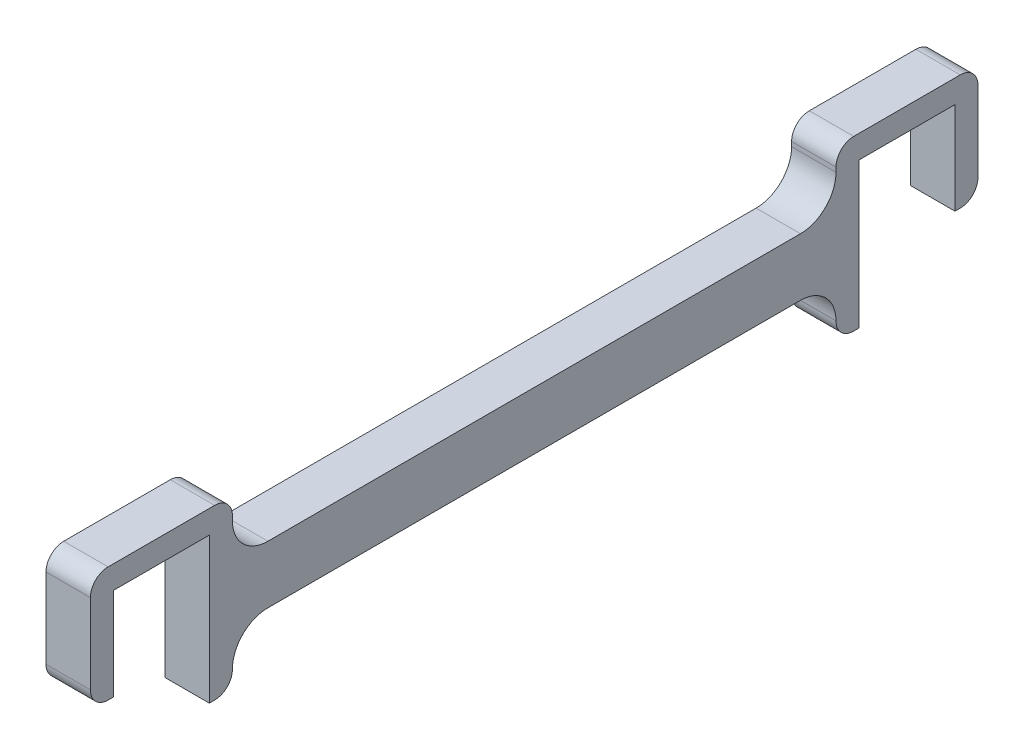
ISO-10303-21;
HEADER;
FILE_DESCRIPTION(('STEP AP214'),'2;1');
FILE_NAME('part.step','',(''),(''),'','','');
FILE_SCHEMA(('AUTOMOTIVE_DESIGN { 1 0 10303 214 1 1 1 1 }'));
ENDSEC;
DATA;
#1=APPLICATION_CONTEXT('core data for automotive mechanical design processes');
#2=APPLICATION_PROTOCOL_DEFINITION('international standard','automotive_design',2000,#1);
#3=PRODUCT_CONTEXT('',#1,'mechanical');
#4=PRODUCT('Part','Part','',(#3));
#5=PRODUCT_RELATED_PRODUCT_CATEGORY('part','',(#4));
#6=PRODUCT_DEFINITION_FORMATION('','',#4);
#7=PRODUCT_DEFINITION_CONTEXT('part definition',#1,'design');
#8=PRODUCT_DEFINITION('design','',#6,#7);
#9=PRODUCT_DEFINITION_SHAPE('','',#8);
#10=(LENGTH_UNIT() NAMED_UNIT(*) SI_UNIT(.MILLI.,.METRE.));
#11=(NAMED_UNIT(*) PLANE_ANGLE_UNIT() SI_UNIT($,.RADIAN.));
#12=(NAMED_UNIT(*) SI_UNIT($,.STERADIAN.) SOLID_ANGLE_UNIT());
#13=UNCERTAINTY_MEASURE_WITH_UNIT(LENGTH_MEASURE(1.E-05),#10,'distance_accuracy_value','');
#14=(GEOMETRIC_REPRESENTATION_CONTEXT(3) GLOBAL_UNCERTAINTY_ASSIGNED_CONTEXT((#13)) GLOBAL_UNIT_ASSIGNED_CONTEXT((#10,
#11,#12)) REPRESENTATION_CONTEXT('',''));
#15=CARTESIAN_POINT('',(0.,0.,0.));
#16=DIRECTION('',(0.,0.,1.));
#17=DIRECTION('',(1.,0.,0.));
#18=AXIS2_PLACEMENT_3D('',#15,#16,#17);
#19=CARTESIAN_POINT('',(5.,97.5,80.));
#20=DIRECTION('',(-1.,0.,0.));
#21=DIRECTION('',(0.,0.,1.));
#22=AXIS2_PLACEMENT_3D('',#19,#20,#21);
#23=CYLINDRICAL_SURFACE('',#22,4.);
#24=CARTESIAN_POINT('',(0.,97.5,80.));
#25=DIRECTION('',(1.,0.,0.));
#26=DIRECTION('',(0.,0.,-1.));
#27=AXIS2_PLACEMENT_3D('',#24,#25,#26);
#28=CIRCLE('',#27,4.);
#29=CARTESIAN_POINT('',(0.,97.5,84.));
#30=VERTEX_POINT('',#29);
#31=CARTESIAN_POINT('',(0.,93.5,80.));
#32=VERTEX_POINT('',#31);
#33=EDGE_CURVE('E278',#30,#32,#28,.T.);
#34=ORIENTED_EDGE('',*,*,#33,.F.);
#35=DIRECTION('',(-1.,0.,0.));
#36=VECTOR('',#35,1.);
#37=CARTESIAN_POINT('',(5.,97.5,84.));
#38=LINE('',#37,#36);
#39=CARTESIAN_POINT('',(5.,97.5,84.));
#40=VERTEX_POINT('',#39);
#41=EDGE_CURVE('E11',#40,#30,#38,.T.);
#42=ORIENTED_EDGE('',*,*,#41,.F.);
#43=CARTESIAN_POINT('',(5.,97.5,80.));
#44=DIRECTION('',(1.,0.,0.));
#45=DIRECTION('',(0.,0.,-1.));
#46=AXIS2_PLACEMENT_3D('',#43,#44,#45);
#47=CIRCLE('',#46,4.);
#48=CARTESIAN_POINT('',(5.,93.5,80.));
#49=VERTEX_POINT('',#48);
#50=EDGE_CURVE('E359',#40,#49,#47,.T.);
#51=ORIENTED_EDGE('',*,*,#50,.T.);
#52=DIRECTION('',(-1.,0.,0.));
#53=VECTOR('',#52,1.);
#54=CARTESIAN_POINT('',(5.,93.5,80.));
#55=LINE('',#54,#53);
#56=EDGE_CURVE('E161',#49,#32,#55,.T.);
#57=ORIENTED_EDGE('',*,*,#56,.T.);
#58=EDGE_LOOP('',(#34,#42,#51,#57));
#59=FACE_BOUND('',#58,.T.);
#60=ADVANCED_FACE('F39',(#59),#23,.F.);
#61=CARTESIAN_POINT('',(5.,0.,84.));
#62=DIRECTION('',(0.,0.,1.));
#63=DIRECTION('',(1.,0.,0.));
#64=AXIS2_PLACEMENT_3D('',#61,#62,#63);
#65=PLANE('',#64);
#66=DIRECTION('',(0.,1.,0.));
#67=VECTOR('',#66,1.);
#68=CARTESIAN_POINT('',(0.,0.,84.));
#69=LINE('',#68,#67);
#70=CARTESIAN_POINT('',(0.,98.,84.));
#71=VERTEX_POINT('',#70);
#72=EDGE_CURVE('E281',#30,#71,#69,.T.);
#73=ORIENTED_EDGE('',*,*,#72,.T.);
#74=DIRECTION('',(-1.,0.,0.));
#75=VECTOR('',#74,1.);
#76=CARTESIAN_POINT('',(5.,98.,84.));
#77=LINE('',#76,#75);
#78=CARTESIAN_POINT('',(5.,98.,84.));
#79=VERTEX_POINT('',#78);
#80=EDGE_CURVE('E47',#79,#71,#77,.T.);
#81=ORIENTED_EDGE('',*,*,#80,.F.);
#82=DIRECTION('',(0.,1.,0.));
#83=VECTOR('',#82,1.);
#84=CARTESIAN_POINT('',(5.,0.,84.));
#85=LINE('',#84,#83);
#86=EDGE_CURVE('E448',#40,#79,#85,.T.);
#87=ORIENTED_EDGE('',*,*,#86,.F.);
#88=ORIENTED_EDGE('',*,*,#41,.T.);
#89=EDGE_LOOP('',(#73,#81,#87,#88));
#90=FACE_BOUND('',#89,.T.);
#91=ADVANCED_FACE('F518',(#90),#65,.F.);
#92=CARTESIAN_POINT('',(5.,98.,86.));
#93=DIRECTION('',(-1.,0.,0.));
#94=DIRECTION('',(0.,0.,1.));
#95=AXIS2_PLACEMENT_3D('',#92,#93,#94);
#96=CYLINDRICAL_SURFACE('',#95,2.);
#97=CARTESIAN_POINT('',(0.,98.,86.));
#98=DIRECTION('',(1.,0.,0.));
#99=DIRECTION('',(0.,0.,-1.));
#100=AXIS2_PLACEMENT_3D('',#97,#98,#99);
#101=CIRCLE('',#100,2.);
#102=CARTESIAN_POINT('',(0.,100.,86.));
#103=VERTEX_POINT('',#102);
#104=EDGE_CURVE('E283',#71,#103,#101,.T.);
#105=ORIENTED_EDGE('',*,*,#104,.T.);
#106=DIRECTION('',(-1.,0.,0.));
#107=VECTOR('',#106,1.);
#108=CARTESIAN_POINT('',(5.,100.,86.));
#109=LINE('',#108,#107);
#110=CARTESIAN_POINT('',(5.,100.,86.));
#111=VERTEX_POINT('',#110);
#112=EDGE_CURVE('E421',#111,#103,#109,.T.);
#113=ORIENTED_EDGE('',*,*,#112,.F.);
#114=CARTESIAN_POINT('',(5.,98.,86.));
#115=DIRECTION('',(1.,0.,0.));
#116=DIRECTION('',(0.,0.,-1.));
#117=AXIS2_PLACEMENT_3D('',#114,#115,#116);
#118=CIRCLE('',#117,2.);
#119=EDGE_CURVE('E430',#79,#111,#118,.T.);
#120=ORIENTED_EDGE('',*,*,#119,.F.);
#121=ORIENTED_EDGE('',*,*,#80,.T.);
#122=EDGE_LOOP('',(#105,#113,#120,#121));
#123=FACE_BOUND('',#122,.T.);
#124=ADVANCED_FACE('F428',(#123),#96,.T.);
#125=CARTESIAN_POINT('',(5.,100.,0.));
#126=DIRECTION('',(0.,-1.,0.));
#127=DIRECTION('',(0.,0.,-1.));
#128=AXIS2_PLACEMENT_3D('',#125,#126,#127);
#129=PLANE('',#128);
#130=DIRECTION('',(0.,0.,1.));
#131=VECTOR('',#130,1.);
#132=CARTESIAN_POINT('',(0.,100.,0.));
#133=LINE('',#132,#131);
#134=CARTESIAN_POINT('',(0.,100.,98.));
#135=VERTEX_POINT('',#134);
#136=EDGE_CURVE('E285',#103,#135,#133,.T.);
#137=ORIENTED_EDGE('',*,*,#136,.T.);
#138=DIRECTION('',(-1.,0.,0.));
#139=VECTOR('',#138,1.);
#140=CARTESIAN_POINT('',(5.,100.,98.));
#141=LINE('',#140,#139);
#142=CARTESIAN_POINT('',(5.,100.,98.));
#143=VERTEX_POINT('',#142);
#144=EDGE_CURVE('E419',#143,#135,#141,.T.);
#145=ORIENTED_EDGE('',*,*,#144,.F.);
#146=DIRECTION('',(0.,0.,1.));
#147=VECTOR('',#146,1.);
#148=CARTESIAN_POINT('',(5.,100.,0.));
#149=LINE('',#148,#147);
#150=EDGE_CURVE('E442',#111,#143,#149,.T.);
#151=ORIENTED_EDGE('',*,*,#150,.F.);
#152=ORIENTED_EDGE('',*,*,#112,.T.);
#153=EDGE_LOOP('',(#137,#145,#151,#152));
#154=FACE_BOUND('',#153,.T.);
#155=ADVANCED_FACE('F439',(#154),#129,.F.);
#156=CARTESIAN_POINT('',(5.,98.,98.));
#157=DIRECTION('',(-1.,0.,0.));
#158=DIRECTION('',(0.,0.,1.));
#159=AXIS2_PLACEMENT_3D('',#156,#157,#158);
#160=CYLINDRICAL_SURFACE('',#159,2.);
#161=CARTESIAN_POINT('',(0.,98.,98.));
#162=DIRECTION('',(1.,0.,0.));
#163=DIRECTION('',(0.,0.,-1.));
#164=AXIS2_PLACEMENT_3D('',#161,#162,#163);
#165=CIRCLE('',#164,2.);
#166=CARTESIAN_POINT('',(0.,98.,100.));
#167=VERTEX_POINT('',#166);
#168=EDGE_CURVE('E288',#167,#135,#165,.F.);
#169=ORIENTED_EDGE('',*,*,#168,.F.);
#170=DIRECTION('',(-1.,0.,0.));
#171=VECTOR('',#170,1.);
#172=CARTESIAN_POINT('',(5.,98.,100.));
#173=LINE('',#172,#171);
#174=CARTESIAN_POINT('',(5.,98.,100.));
#175=VERTEX_POINT('',#174);
#176=EDGE_CURVE('E417',#175,#167,#173,.T.);
#177=ORIENTED_EDGE('',*,*,#176,.F.);
#178=CARTESIAN_POINT('',(5.,98.,98.));
#179=DIRECTION('',(1.,0.,0.));
#180=DIRECTION('',(0.,0.,-1.));
#181=AXIS2_PLACEMENT_3D('',#178,#179,#180);
#182=CIRCLE('',#181,2.);
#183=EDGE_CURVE('E444',#175,#143,#182,.F.);
#184=ORIENTED_EDGE('',*,*,#183,.T.);
#185=ORIENTED_EDGE('',*,*,#144,.T.);
#186=EDGE_LOOP('',(#169,#177,#184,#185));
#187=FACE_BOUND('',#186,.T.);
#188=ADVANCED_FACE('F528',(#187),#160,.T.);
#189=CARTESIAN_POINT('',(5.,0.,100.));
#190=DIRECTION('',(0.,0.,1.));
#191=DIRECTION('',(1.,0.,0.));
#192=AXIS2_PLACEMENT_3D('',#189,#190,#191);
#193=PLANE('',#192);
#194=DIRECTION('',(0.,1.,0.));
#195=VECTOR('',#194,1.);
#196=CARTESIAN_POINT('',(0.,0.,100.));
#197=LINE('',#196,#195);
#198=CARTESIAN_POINT('',(0.,88.9999999999946,100.));
#199=VERTEX_POINT('',#198);
#200=EDGE_CURVE('E291',#199,#167,#197,.T.);
#201=ORIENTED_EDGE('',*,*,#200,.F.);
#202=DIRECTION('',(-1.,0.,0.));
#203=VECTOR('',#202,1.);
#204=CARTESIAN_POINT('',(5.,88.9999999999946,100.));
#205=LINE('',#204,#203);
#206=CARTESIAN_POINT('',(5.,88.9999999999946,100.));
#207=VERTEX_POINT('',#206);
#208=EDGE_CURVE('E415',#207,#199,#205,.T.);
#209=ORIENTED_EDGE('',*,*,#208,.F.);
#210=DIRECTION('',(0.,1.,0.));
#211=VECTOR('',#210,1.);
#212=CARTESIAN_POINT('',(5.,0.,100.));
#213=LINE('',#212,#211);
#214=EDGE_CURVE('E446',#207,#175,#213,.T.);
#215=ORIENTED_EDGE('',*,*,#214,.T.);
#216=ORIENTED_EDGE('',*,*,#176,.T.);
#217=EDGE_LOOP('',(#201,#209,#215,#216));
#218=FACE_BOUND('',#217,.T.);
#219=ADVANCED_FACE('F531',(#218),#193,.T.);
#220=CARTESIAN_POINT('',(5.,88.9999999999946,98.));
#221=DIRECTION('',(-1.,0.,0.));
#222=DIRECTION('',(0.,0.,1.));
#223=AXIS2_PLACEMENT_3D('',#220,#221,#222);
#224=CYLINDRICAL_SURFACE('',#223,2.);
#225=CARTESIAN_POINT('',(0.,88.9999999999946,98.));
#226=DIRECTION('',(1.,0.,0.));
#227=DIRECTION('',(0.,0.,-1.));
#228=AXIS2_PLACEMENT_3D('',#225,#226,#227);
#229=CIRCLE('',#228,2.);
#230=CARTESIAN_POINT('',(0.,86.9999999999946,98.));
#231=VERTEX_POINT('',#230);
#232=EDGE_CURVE('E294',#231,#199,#229,.F.);
#233=ORIENTED_EDGE('',*,*,#232,.F.);
#234=DIRECTION('',(-1.,0.,0.));
#235=VECTOR('',#234,1.);
#236=CARTESIAN_POINT('',(5.,86.9999999999946,98.));
#237=LINE('',#236,#235);
#238=CARTESIAN_POINT('',(5.,86.9999999999946,98.));
#239=VERTEX_POINT('',#238);
#240=EDGE_CURVE('E413',#239,#231,#237,.T.);
#241=ORIENTED_EDGE('',*,*,#240,.F.);
#242=CARTESIAN_POINT('',(5.,88.9999999999946,98.));
#243=DIRECTION('',(1.,0.,0.));
#244=DIRECTION('',(0.,0.,-1.));
#245=AXIS2_PLACEMENT_3D('',#242,#243,#244);
#246=CIRCLE('',#245,2.);
#247=EDGE_CURVE('E454',#239,#207,#246,.F.);
#248=ORIENTED_EDGE('',*,*,#247,.T.);
#249=ORIENTED_EDGE('',*,*,#208,.T.);
#250=EDGE_LOOP('',(#233,#241,#248,#249));
#251=FACE_BOUND('',#250,.T.);
#252=ADVANCED_FACE('F535',(#251),#224,.T.);
#253=CARTESIAN_POINT('',(5.,86.9999999999946,0.));
#254=DIRECTION('',(0.,-1.,0.));
#255=DIRECTION('',(0.,0.,-1.));
#256=AXIS2_PLACEMENT_3D('',#253,#254,#255);
#257=PLANE('',#256);
#258=DIRECTION('',(0.,0.,1.));
#259=VECTOR('',#258,1.);
#260=CARTESIAN_POINT('',(0.,86.9999999999946,0.));
#261=LINE('',#260,#259);
#262=CARTESIAN_POINT('',(0.,86.9999999999946,97.4));
#263=VERTEX_POINT('',#262);
#264=EDGE_CURVE('E297',#263,#231,#261,.T.);
#265=ORIENTED_EDGE('',*,*,#264,.F.);
#266=DIRECTION('',(-1.,0.,0.));
#267=VECTOR('',#266,1.);
#268=CARTESIAN_POINT('',(5.,86.9999999999946,97.4));
#269=LINE('',#268,#267);
#270=CARTESIAN_POINT('',(5.,86.9999999999946,97.4));
#271=VERTEX_POINT('',#270);
#272=EDGE_CURVE('E411',#271,#263,#269,.T.);
#273=ORIENTED_EDGE('',*,*,#272,.F.);
#274=DIRECTION('',(0.,0.,1.));
#275=VECTOR('',#274,1.);
#276=CARTESIAN_POINT('',(5.,86.9999999999946,0.));
#277=LINE('',#276,#275);
#278=EDGE_CURVE('E457',#271,#239,#277,.T.);
#279=ORIENTED_EDGE('',*,*,#278,.T.);
#280=ORIENTED_EDGE('',*,*,#240,.T.);
#281=EDGE_LOOP('',(#265,#273,#279,#280));
#282=FACE_BOUND('',#281,.T.);
#283=ADVANCED_FACE('F539',(#282),#257,.T.);
#284=CARTESIAN_POINT('',(5.,1.29970820430878E-13,97.4000000000001));
#285=DIRECTION('',(0.,0.,-1.));
#286=DIRECTION('',(0.,1.,0.));
#287=AXIS2_PLACEMENT_3D('',#284,#285,#286);
#288=PLANE('',#287);
#289=DIRECTION('',(0.,-1.,0.));
#290=VECTOR('',#289,1.);
#291=CARTESIAN_POINT('',(0.,1.29970820430878E-13,97.4000000000001));
#292=LINE('',#291,#290);
#293=CARTESIAN_POINT('',(0.,97.3999999999946,97.4));
#294=VERTEX_POINT('',#293);
#295=EDGE_CURVE('E300',#294,#263,#292,.T.);
#296=ORIENTED_EDGE('',*,*,#295,.F.);
#297=DIRECTION('',(-1.,0.,0.));
#298=VECTOR('',#297,1.);
#299=CARTESIAN_POINT('',(5.,97.3999999999946,97.4));
#300=LINE('',#299,#298);
#301=CARTESIAN_POINT('',(5.,97.3999999999946,97.4));
#302=VERTEX_POINT('',#301);
#303=EDGE_CURVE('E409',#302,#294,#300,.T.);
#304=ORIENTED_EDGE('',*,*,#303,.F.);
#305=DIRECTION('',(0.,-1.,0.));
#306=VECTOR('',#305,1.);
#307=CARTESIAN_POINT('',(5.,1.29970820430878E-13,97.4000000000001));
#308=LINE('',#307,#306);
#309=EDGE_CURVE('E460',#302,#271,#308,.T.);
#310=ORIENTED_EDGE('',*,*,#309,.T.);
#311=ORIENTED_EDGE('',*,*,#272,.T.);
#312=EDGE_LOOP('',(#296,#304,#310,#311));
#313=FACE_BOUND('',#312,.T.);
#314=ADVANCED_FACE('F543',(#313),#288,.T.);
#315=CARTESIAN_POINT('',(5.,97.3999999999944,-1.25157086340838E-13));
#316=DIRECTION('',(0.,1.,0.));
#317=DIRECTION('',(0.,0.,1.));
#318=AXIS2_PLACEMENT_3D('',#315,#316,#317);
#319=PLANE('',#318);
#320=DIRECTION('',(0.,0.,-1.));
#321=VECTOR('',#320,1.);
#322=CARTESIAN_POINT('',(0.,97.3999999999944,-1.25157086340838E-13));
#323=LINE('',#322,#321);
#324=CARTESIAN_POINT('',(0.,97.3999999999945,86.6));
#325=VERTEX_POINT('',#324);
#326=EDGE_CURVE('E303',#294,#325,#323,.T.);
#327=ORIENTED_EDGE('',*,*,#326,.T.);
#328=DIRECTION('',(-1.,0.,0.));
#329=VECTOR('',#328,1.);
#330=CARTESIAN_POINT('',(5.,97.3999999999945,86.6));
#331=LINE('',#330,#329);
#332=CARTESIAN_POINT('',(5.,97.3999999999945,86.6));
#333=VERTEX_POINT('',#332);
#334=EDGE_CURVE('E406',#333,#325,#331,.T.);
#335=ORIENTED_EDGE('',*,*,#334,.F.);
#336=DIRECTION('',(0.,0.,-1.));
#337=VECTOR('',#336,1.);
#338=CARTESIAN_POINT('',(5.,97.3999999999944,-1.25157086340838E-13));
#339=LINE('',#338,#337);
#340=EDGE_CURVE('E463',#302,#333,#339,.T.);
#341=ORIENTED_EDGE('',*,*,#340,.F.);
#342=ORIENTED_EDGE('',*,*,#303,.T.);
#343=EDGE_LOOP('',(#327,#335,#341,#342));
#344=FACE_BOUND('',#343,.T.);
#345=ADVANCED_FACE('F547',(#344),#319,.F.);
#346=CARTESIAN_POINT('',(5.,-1.15559271553532E-13,86.5999999999999));
#347=DIRECTION('',(0.,0.,-1.));
#348=DIRECTION('',(0.,1.,0.));
#349=AXIS2_PLACEMENT_3D('',#346,#347,#348);
#350=PLANE('',#349);
#351=DIRECTION('',(0.,-1.,0.));
#352=VECTOR('',#351,1.);
#353=CARTESIAN_POINT('',(0.,-1.15559271553532E-13,86.5999999999999));
#354=LINE('',#353,#352);
#355=CARTESIAN_POINT('',(0.,80.9999999999945,86.6));
#356=VERTEX_POINT('',#355);
#357=EDGE_CURVE('E305',#325,#356,#354,.T.);
#358=ORIENTED_EDGE('',*,*,#357,.T.);
#359=DIRECTION('',(-1.,0.,0.));
#360=VECTOR('',#359,1.);
#361=CARTESIAN_POINT('',(5.,80.9999999999945,86.6));
#362=LINE('',#361,#360);
#363=CARTESIAN_POINT('',(5.,80.9999999999945,86.6));
#364=VERTEX_POINT('',#363);
#365=EDGE_CURVE('E403',#364,#356,#362,.T.);
#366=ORIENTED_EDGE('',*,*,#365,.F.);
#367=DIRECTION('',(0.,-1.,0.));
#368=VECTOR('',#367,1.);
#369=CARTESIAN_POINT('',(5.,-1.15559271553532E-13,86.5999999999999));
#370=LINE('',#369,#368);
#371=EDGE_CURVE('E465',#333,#364,#370,.T.);
#372=ORIENTED_EDGE('',*,*,#371,.F.);
#373=ORIENTED_EDGE('',*,*,#334,.T.);
#374=EDGE_LOOP('',(#358,#366,#372,#373));
#375=FACE_BOUND('',#374,.T.);
#376=ADVANCED_FACE('F551',(#375),#350,.F.);
#377=CARTESIAN_POINT('',(5.,80.9999999999945,0.));
#378=DIRECTION('',(0.,1.,0.));
#379=DIRECTION('',(0.,0.,1.));
#380=AXIS2_PLACEMENT_3D('',#377,#378,#379);
#381=PLANE('',#380);
#382=DIRECTION('',(0.,0.,-1.));
#383=VECTOR('',#382,1.);
#384=CARTESIAN_POINT('',(0.,80.9999999999945,0.));
#385=LINE('',#384,#383);
#386=CARTESIAN_POINT('',(0.,80.9999999999945,85.99));
#387=VERTEX_POINT('',#386);
#388=EDGE_CURVE('E307',#356,#387,#385,.T.);
#389=ORIENTED_EDGE('',*,*,#388,.T.);
#390=DIRECTION('',(-1.,0.,0.));
#391=VECTOR('',#390,1.);
#392=CARTESIAN_POINT('',(5.,80.9999999999945,85.99));
#393=LINE('',#392,#391);
#394=CARTESIAN_POINT('',(5.,80.9999999999945,85.99));
#395=VERTEX_POINT('',#394);
#396=EDGE_CURVE('E401',#395,#387,#393,.T.);
#397=ORIENTED_EDGE('',*,*,#396,.F.);
#398=DIRECTION('',(0.,0.,-1.));
#399=VECTOR('',#398,1.);
#400=CARTESIAN_POINT('',(5.,80.9999999999945,0.));
#401=LINE('',#400,#399);
#402=EDGE_CURVE('E467',#364,#395,#401,.T.);
#403=ORIENTED_EDGE('',*,*,#402,.F.);
#404=ORIENTED_EDGE('',*,*,#365,.T.);
#405=EDGE_LOOP('',(#389,#397,#403,#404));
#406=FACE_BOUND('',#405,.T.);
#407=ADVANCED_FACE('F555',(#406),#381,.F.);
#408=CARTESIAN_POINT('',(5.,82.9899999999946,85.99));
#409=DIRECTION('',(-1.,0.,0.));
#410=DIRECTION('',(0.,0.,1.));
#411=AXIS2_PLACEMENT_3D('',#408,#409,#410);
#412=CYLINDRICAL_SURFACE('',#411,1.99000000000001);
#413=CARTESIAN_POINT('',(0.,82.9899999999946,85.99));
#414=DIRECTION('',(1.,0.,0.));
#415=DIRECTION('',(0.,0.,-1.));
#416=AXIS2_PLACEMENT_3D('',#413,#414,#415);
#417=CIRCLE('',#416,1.99000000000001);
#418=CARTESIAN_POINT('',(0.,82.9899999999946,84.));
#419=VERTEX_POINT('',#418);
#420=EDGE_CURVE('E310',#419,#387,#417,.F.);
#421=ORIENTED_EDGE('',*,*,#420,.F.);
#422=DIRECTION('',(-1.,0.,0.));
#423=VECTOR('',#422,1.);
#424=CARTESIAN_POINT('',(5.,82.9899999999946,84.));
#425=LINE('',#424,#423);
#426=CARTESIAN_POINT('',(5.,82.9899999999946,84.));
#427=VERTEX_POINT('',#426);
#428=EDGE_CURVE('E399',#427,#419,#425,.T.);
#429=ORIENTED_EDGE('',*,*,#428,.F.);
#430=CARTESIAN_POINT('',(5.,82.9899999999946,85.99));
#431=DIRECTION('',(1.,0.,0.));
#432=DIRECTION('',(0.,0.,-1.));
#433=AXIS2_PLACEMENT_3D('',#430,#431,#432);
#434=CIRCLE('',#433,1.99000000000001);
#435=EDGE_CURVE('E469',#427,#395,#434,.F.);
#436=ORIENTED_EDGE('',*,*,#435,.T.);
#437=ORIENTED_EDGE('',*,*,#396,.T.);
#438=EDGE_LOOP('',(#421,#429,#436,#437));
#439=FACE_BOUND('',#438,.T.);
#440=ADVANCED_FACE('F559',(#439),#412,.T.);
#441=CARTESIAN_POINT('',(5.,0.,84.));
#442=DIRECTION('',(0.,0.,-1.));
#443=DIRECTION('',(-1.,0.,0.));
#444=AXIS2_PLACEMENT_3D('',#441,#442,#443);
#445=PLANE('',#444);
#446=DIRECTION('',(0.,-1.,0.));
#447=VECTOR('',#446,1.);
#448=CARTESIAN_POINT('',(0.,0.,84.));
#449=LINE('',#448,#447);
#450=CARTESIAN_POINT('',(0.,83.0099999999945,84.));
#451=VERTEX_POINT('',#450);
#452=EDGE_CURVE('E313',#451,#419,#449,.T.);
#453=ORIENTED_EDGE('',*,*,#452,.F.);
#454=DIRECTION('',(-1.,0.,0.));
#455=VECTOR('',#454,1.);
#456=CARTESIAN_POINT('',(5.,83.0099999999945,84.));
#457=LINE('',#456,#455);
#458=CARTESIAN_POINT('',(5.,83.0099999999945,84.));
#459=VERTEX_POINT('',#458);
#460=EDGE_CURVE('E397',#459,#451,#457,.T.);
#461=ORIENTED_EDGE('',*,*,#460,.F.);
#462=DIRECTION('',(0.,-1.,0.));
#463=VECTOR('',#462,1.);
#464=CARTESIAN_POINT('',(5.,0.,84.));
#465=LINE('',#464,#463);
#466=EDGE_CURVE('E472',#459,#427,#465,.T.);
#467=ORIENTED_EDGE('',*,*,#466,.T.);
#468=ORIENTED_EDGE('',*,*,#428,.T.);
#469=EDGE_LOOP('',(#453,#461,#467,#468));
#470=FACE_BOUND('',#469,.T.);
#471=ADVANCED_FACE('F563',(#470),#445,.T.);
#472=CARTESIAN_POINT('',(5.,83.0099999999946,80.01));
#473=DIRECTION('',(-1.,0.,0.));
#474=DIRECTION('',(0.,0.,1.));
#475=AXIS2_PLACEMENT_3D('',#472,#473,#474);
#476=CYLINDRICAL_SURFACE('',#475,3.99);
#477=CARTESIAN_POINT('',(0.,83.0099999999946,80.01));
#478=DIRECTION('',(1.,0.,0.));
#479=DIRECTION('',(0.,0.,-1.));
#480=AXIS2_PLACEMENT_3D('',#477,#478,#479);
#481=CIRCLE('',#480,3.99);
#482=CARTESIAN_POINT('',(0.,86.9999999999946,80.01));
#483=VERTEX_POINT('',#482);
#484=EDGE_CURVE('E316',#483,#451,#481,.T.);
#485=ORIENTED_EDGE('',*,*,#484,.F.);
#486=DIRECTION('',(-1.,0.,0.));
#487=VECTOR('',#486,1.);
#488=CARTESIAN_POINT('',(5.,86.9999999999946,80.01));
#489=LINE('',#488,#487);
#490=CARTESIAN_POINT('',(5.,86.9999999999946,80.01));
#491=VERTEX_POINT('',#490);
#492=EDGE_CURVE('E395',#491,#483,#489,.T.);
#493=ORIENTED_EDGE('',*,*,#492,.F.);
#494=CARTESIAN_POINT('',(5.,83.0099999999946,80.01));
#495=DIRECTION('',(1.,0.,0.));
#496=DIRECTION('',(0.,0.,-1.));
#497=AXIS2_PLACEMENT_3D('',#494,#495,#496);
#498=CIRCLE('',#497,3.99);
#499=EDGE_CURVE('E475',#491,#459,#498,.T.);
#500=ORIENTED_EDGE('',*,*,#499,.T.);
#501=ORIENTED_EDGE('',*,*,#460,.T.);
#502=EDGE_LOOP('',(#485,#493,#500,#501));
#503=FACE_BOUND('',#502,.T.);
#504=ADVANCED_FACE('F567',(#503),#476,.F.);
#505=CARTESIAN_POINT('',(5.,86.9999999999946,0.));
#506=DIRECTION('',(0.,-1.,0.));
#507=DIRECTION('',(0.,0.,-1.));
#508=AXIS2_PLACEMENT_3D('',#505,#506,#507);
#509=PLANE('',#508);
#510=DIRECTION('',(0.,0.,1.));
#511=VECTOR('',#510,1.);
#512=CARTESIAN_POINT('',(0.,86.9999999999946,0.));
#513=LINE('',#512,#511);
#514=CARTESIAN_POINT('',(0.,86.9999999999946,19.99));
#515=VERTEX_POINT('',#514);
#516=EDGE_CURVE('E319',#515,#483,#513,.T.);
#517=ORIENTED_EDGE('',*,*,#516,.F.);
#518=DIRECTION('',(-1.,0.,0.));
#519=VECTOR('',#518,1.);
#520=CARTESIAN_POINT('',(5.,86.9999999999946,19.99));
#521=LINE('',#520,#519);
#522=CARTESIAN_POINT('',(5.,86.9999999999946,19.99));
#523=VERTEX_POINT('',#522);
#524=EDGE_CURVE('E393',#523,#515,#521,.T.);
#525=ORIENTED_EDGE('',*,*,#524,.F.);
#526=DIRECTION('',(0.,0.,1.));
#527=VECTOR('',#526,1.);
#528=CARTESIAN_POINT('',(5.,86.9999999999946,0.));
#529=LINE('',#528,#527);
#530=EDGE_CURVE('E478',#523,#491,#529,.T.);
#531=ORIENTED_EDGE('',*,*,#530,.T.);
#532=ORIENTED_EDGE('',*,*,#492,.T.);
#533=EDGE_LOOP('',(#517,#525,#531,#532));
#534=FACE_BOUND('',#533,.T.);
#535=ADVANCED_FACE('F571',(#534),#509,.T.);
#536=CARTESIAN_POINT('',(5.,83.0099999999946,19.99));
#537=DIRECTION('',(-1.,0.,0.));
#538=DIRECTION('',(0.,0.,1.));
#539=AXIS2_PLACEMENT_3D('',#536,#537,#538);
#540=CYLINDRICAL_SURFACE('',#539,3.99);
#541=CARTESIAN_POINT('',(0.,83.0099999999946,19.99));
#542=DIRECTION('',(1.,0.,0.));
#543=DIRECTION('',(0.,0.,-1.));
#544=AXIS2_PLACEMENT_3D('',#541,#542,#543);
#545=CIRCLE('',#544,3.99);
#546=CARTESIAN_POINT('',(0.,83.0099999999945,16.));
#547=VERTEX_POINT('',#546);
#548=EDGE_CURVE('E322',#515,#547,#545,.F.);
#549=ORIENTED_EDGE('',*,*,#548,.T.);
#550=DIRECTION('',(-1.,0.,0.));
#551=VECTOR('',#550,1.);
#552=CARTESIAN_POINT('',(5.,83.0099999999945,16.));
#553=LINE('',#552,#551);
#554=CARTESIAN_POINT('',(5.,83.0099999999945,16.));
#555=VERTEX_POINT('',#554);
#556=EDGE_CURVE('E390',#555,#547,#553,.T.);
#557=ORIENTED_EDGE('',*,*,#556,.F.);
#558=CARTESIAN_POINT('',(5.,83.0099999999946,19.99));
#559=DIRECTION('',(1.,0.,0.));
#560=DIRECTION('',(0.,0.,-1.));
#561=AXIS2_PLACEMENT_3D('',#558,#559,#560);
#562=CIRCLE('',#561,3.99);
#563=EDGE_CURVE('E481',#523,#555,#562,.F.);
#564=ORIENTED_EDGE('',*,*,#563,.F.);
#565=ORIENTED_EDGE('',*,*,#524,.T.);
#566=EDGE_LOOP('',(#549,#557,#564,#565));
#567=FACE_BOUND('',#566,.T.);
#568=ADVANCED_FACE('F575',(#567),#540,.F.);
#569=CARTESIAN_POINT('',(5.,0.,16.));
#570=DIRECTION('',(0.,0.,-1.));
#571=DIRECTION('',(-1.,0.,0.));
#572=AXIS2_PLACEMENT_3D('',#569,#570,#571);
#573=PLANE('',#572);
#574=DIRECTION('',(0.,-1.,0.));
#575=VECTOR('',#574,1.);
#576=CARTESIAN_POINT('',(0.,0.,16.));
#577=LINE('',#576,#575);
#578=CARTESIAN_POINT('',(0.,82.9899999999946,16.));
#579=VERTEX_POINT('',#578);
#580=EDGE_CURVE('E324',#547,#579,#577,.T.);
#581=ORIENTED_EDGE('',*,*,#580,.T.);
#582=DIRECTION('',(-1.,0.,0.));
#583=VECTOR('',#582,1.);
#584=CARTESIAN_POINT('',(5.,82.9899999999946,16.));
#585=LINE('',#584,#583);
#586=CARTESIAN_POINT('',(5.,82.9899999999946,16.));
#587=VERTEX_POINT('',#586);
#588=EDGE_CURVE('E387',#587,#579,#585,.T.);
#589=ORIENTED_EDGE('',*,*,#588,.F.);
#590=DIRECTION('',(0.,-1.,0.));
#591=VECTOR('',#590,1.);
#592=CARTESIAN_POINT('',(5.,0.,16.));
#593=LINE('',#592,#591);
#594=EDGE_CURVE('E483',#555,#587,#593,.T.);
#595=ORIENTED_EDGE('',*,*,#594,.F.);
#596=ORIENTED_EDGE('',*,*,#556,.T.);
#597=EDGE_LOOP('',(#581,#589,#595,#596));
#598=FACE_BOUND('',#597,.T.);
#599=ADVANCED_FACE('F579',(#598),#573,.F.);
#600=CARTESIAN_POINT('',(5.,82.9899999999946,14.01));
#601=DIRECTION('',(-1.,0.,0.));
#602=DIRECTION('',(0.,0.,1.));
#603=AXIS2_PLACEMENT_3D('',#600,#601,#602);
#604=CYLINDRICAL_SURFACE('',#603,1.99);
#605=CARTESIAN_POINT('',(0.,82.9899999999946,14.01));
#606=DIRECTION('',(1.,0.,0.));
#607=DIRECTION('',(0.,0.,-1.));
#608=AXIS2_PLACEMENT_3D('',#605,#606,#607);
#609=CIRCLE('',#608,1.99);
#610=CARTESIAN_POINT('',(0.,80.9999999999945,14.01));
#611=VERTEX_POINT('',#610);
#612=EDGE_CURVE('E326',#579,#611,#609,.T.);
#613=ORIENTED_EDGE('',*,*,#612,.T.);
#614=DIRECTION('',(-1.,0.,0.));
#615=VECTOR('',#614,1.);
#616=CARTESIAN_POINT('',(5.,80.9999999999945,14.01));
#617=LINE('',#616,#615);
#618=CARTESIAN_POINT('',(5.,80.9999999999945,14.01));
#619=VERTEX_POINT('',#618);
#620=EDGE_CURVE('E385',#619,#611,#617,.T.);
#621=ORIENTED_EDGE('',*,*,#620,.F.);
#622=CARTESIAN_POINT('',(5.,82.9899999999946,14.01));
#623=DIRECTION('',(1.,0.,0.));
#624=DIRECTION('',(0.,0.,-1.));
#625=AXIS2_PLACEMENT_3D('',#622,#623,#624);
#626=CIRCLE('',#625,1.99);
#627=EDGE_CURVE('E485',#587,#619,#626,.T.);
#628=ORIENTED_EDGE('',*,*,#627,.F.);
#629=ORIENTED_EDGE('',*,*,#588,.T.);
#630=EDGE_LOOP('',(#613,#621,#628,#629));
#631=FACE_BOUND('',#630,.T.);
#632=ADVANCED_FACE('F583',(#631),#604,.T.);
#633=CARTESIAN_POINT('',(5.,80.9999999999945,0.));
#634=DIRECTION('',(0.,-1.,0.));
#635=DIRECTION('',(0.,0.,-1.));
#636=AXIS2_PLACEMENT_3D('',#633,#634,#635);
#637=PLANE('',#636);
#638=DIRECTION('',(0.,0.,1.));
#639=VECTOR('',#638,1.);
#640=CARTESIAN_POINT('',(0.,80.9999999999945,0.));
#641=LINE('',#640,#639);
#642=CARTESIAN_POINT('',(0.,80.9999999999945,13.4));
#643=VERTEX_POINT('',#642);
#644=EDGE_CURVE('E329',#643,#611,#641,.T.);
#645=ORIENTED_EDGE('',*,*,#644,.F.);
#646=DIRECTION('',(-1.,0.,0.));
#647=VECTOR('',#646,1.);
#648=CARTESIAN_POINT('',(5.,80.9999999999945,13.4));
#649=LINE('',#648,#647);
#650=CARTESIAN_POINT('',(5.,80.9999999999945,13.4));
#651=VERTEX_POINT('',#650);
#652=EDGE_CURVE('E383',#651,#643,#649,.T.);
#653=ORIENTED_EDGE('',*,*,#652,.F.);
#654=DIRECTION('',(0.,0.,1.));
#655=VECTOR('',#654,1.);
#656=CARTESIAN_POINT('',(5.,80.9999999999945,0.));
#657=LINE('',#656,#655);
#658=EDGE_CURVE('E487',#651,#619,#657,.T.);
#659=ORIENTED_EDGE('',*,*,#658,.T.);
#660=ORIENTED_EDGE('',*,*,#620,.T.);
#661=EDGE_LOOP('',(#645,#653,#659,#660));
#662=FACE_BOUND('',#661,.T.);
#663=ADVANCED_FACE('F587',(#662),#637,.T.);
#664=CARTESIAN_POINT('',(5.,0.,13.4));
#665=DIRECTION('',(0.,0.,-1.));
#666=DIRECTION('',(-1.,0.,0.));
#667=AXIS2_PLACEMENT_3D('',#664,#665,#666);
#668=PLANE('',#667);
#669=DIRECTION('',(0.,-1.,0.));
#670=VECTOR('',#669,1.);
#671=CARTESIAN_POINT('',(0.,0.,13.4));
#672=LINE('',#671,#670);
#673=CARTESIAN_POINT('',(0.,97.3999999999945,13.4));
#674=VERTEX_POINT('',#673);
#675=EDGE_CURVE('E332',#674,#643,#672,.T.);
#676=ORIENTED_EDGE('',*,*,#675,.F.);
#677=DIRECTION('',(-1.,0.,0.));
#678=VECTOR('',#677,1.);
#679=CARTESIAN_POINT('',(5.,97.3999999999945,13.4));
#680=LINE('',#679,#678);
#681=CARTESIAN_POINT('',(5.,97.3999999999945,13.4));
#682=VERTEX_POINT('',#681);
#683=EDGE_CURVE('E381',#682,#674,#680,.T.);
#684=ORIENTED_EDGE('',*,*,#683,.F.);
#685=DIRECTION('',(0.,-1.,0.));
#686=VECTOR('',#685,1.);
#687=CARTESIAN_POINT('',(5.,0.,13.4));
#688=LINE('',#687,#686);
#689=EDGE_CURVE('E490',#682,#651,#688,.T.);
#690=ORIENTED_EDGE('',*,*,#689,.T.);
#691=ORIENTED_EDGE('',*,*,#652,.T.);
#692=EDGE_LOOP('',(#676,#684,#690,#691));
#693=FACE_BOUND('',#692,.T.);
#694=ADVANCED_FACE('F591',(#693),#668,.T.);
#695=CARTESIAN_POINT('',(5.,97.3999999999946,1.25157086340838E-13));
#696=DIRECTION('',(0.,-1.,0.));
#697=DIRECTION('',(0.,0.,-1.));
#698=AXIS2_PLACEMENT_3D('',#695,#696,#697);
#699=PLANE('',#698);
#700=DIRECTION('',(0.,0.,1.));
#701=VECTOR('',#700,1.);
#702=CARTESIAN_POINT('',(0.,97.3999999999946,1.25157086340838E-13));
#703=LINE('',#702,#701);
#704=CARTESIAN_POINT('',(0.,97.3999999999946,2.6));
#705=VERTEX_POINT('',#704);
#706=EDGE_CURVE('E335',#705,#674,#703,.T.);
#707=ORIENTED_EDGE('',*,*,#706,.F.);
#708=DIRECTION('',(-1.,0.,0.));
#709=VECTOR('',#708,1.);
#710=CARTESIAN_POINT('',(5.,97.3999999999946,2.6));
#711=LINE('',#710,#709);
#712=CARTESIAN_POINT('',(5.,97.3999999999946,2.6));
#713=VERTEX_POINT('',#712);
#714=EDGE_CURVE('E379',#713,#705,#711,.T.);
#715=ORIENTED_EDGE('',*,*,#714,.F.);
#716=DIRECTION('',(0.,0.,1.));
#717=VECTOR('',#716,1.);
#718=CARTESIAN_POINT('',(5.,97.3999999999946,1.25157086340838E-13));
#719=LINE('',#718,#717);
#720=EDGE_CURVE('E493',#713,#682,#719,.T.);
#721=ORIENTED_EDGE('',*,*,#720,.T.);
#722=ORIENTED_EDGE('',*,*,#683,.T.);
#723=EDGE_LOOP('',(#707,#715,#721,#722));
#724=FACE_BOUND('',#723,.T.);
#725=ADVANCED_FACE('F595',(#724),#699,.T.);
#726=CARTESIAN_POINT('',(5.,0.,2.59999999999999));
#727=DIRECTION('',(0.,0.,-1.));
#728=DIRECTION('',(0.,1.,0.));
#729=AXIS2_PLACEMENT_3D('',#726,#727,#728);
#730=PLANE('',#729);
#731=DIRECTION('',(0.,-1.,0.));
#732=VECTOR('',#731,1.);
#733=CARTESIAN_POINT('',(0.,0.,2.59999999999999));
#734=LINE('',#733,#732);
#735=CARTESIAN_POINT('',(0.,86.9999999999946,2.6));
#736=VERTEX_POINT('',#735);
#737=EDGE_CURVE('E338',#705,#736,#734,.T.);
#738=ORIENTED_EDGE('',*,*,#737,.T.);
#739=DIRECTION('',(-1.,0.,0.));
#740=VECTOR('',#739,1.);
#741=CARTESIAN_POINT('',(5.,86.9999999999946,2.6));
#742=LINE('',#741,#740);
#743=CARTESIAN_POINT('',(5.,86.9999999999946,2.6));
#744=VERTEX_POINT('',#743);
#745=EDGE_CURVE('E376',#744,#736,#742,.T.);
#746=ORIENTED_EDGE('',*,*,#745,.F.);
#747=DIRECTION('',(0.,-1.,0.));
#748=VECTOR('',#747,1.);
#749=CARTESIAN_POINT('',(5.,0.,2.59999999999999));
#750=LINE('',#749,#748);
#751=EDGE_CURVE('E496',#713,#744,#750,.T.);
#752=ORIENTED_EDGE('',*,*,#751,.F.);
#753=ORIENTED_EDGE('',*,*,#714,.T.);
#754=EDGE_LOOP('',(#738,#746,#752,#753));
#755=FACE_BOUND('',#754,.T.);
#756=ADVANCED_FACE('F599',(#755),#730,.F.);
#757=CARTESIAN_POINT('',(5.,86.9999999999946,0.));
#758=DIRECTION('',(0.,1.,0.));
#759=DIRECTION('',(0.,0.,1.));
#760=AXIS2_PLACEMENT_3D('',#757,#758,#759);
#761=PLANE('',#760);
#762=DIRECTION('',(0.,0.,-1.));
#763=VECTOR('',#762,1.);
#764=CARTESIAN_POINT('',(0.,86.9999999999946,0.));
#765=LINE('',#764,#763);
#766=CARTESIAN_POINT('',(0.,86.9999999999946,2.00000000000001));
#767=VERTEX_POINT('',#766);
#768=EDGE_CURVE('E340',#736,#767,#765,.T.);
#769=ORIENTED_EDGE('',*,*,#768,.T.);
#770=DIRECTION('',(-1.,0.,0.));
#771=VECTOR('',#770,1.);
#772=CARTESIAN_POINT('',(5.,86.9999999999946,2.00000000000001));
#773=LINE('',#772,#771);
#774=CARTESIAN_POINT('',(5.,86.9999999999946,2.00000000000001));
#775=VERTEX_POINT('',#774);
#776=EDGE_CURVE('E373',#775,#767,#773,.T.);
#777=ORIENTED_EDGE('',*,*,#776,.F.);
#778=DIRECTION('',(0.,0.,-1.));
#779=VECTOR('',#778,1.);
#780=CARTESIAN_POINT('',(5.,86.9999999999946,0.));
#781=LINE('',#780,#779);
#782=EDGE_CURVE('E498',#744,#775,#781,.T.);
#783=ORIENTED_EDGE('',*,*,#782,.F.);
#784=ORIENTED_EDGE('',*,*,#745,.T.);
#785=EDGE_LOOP('',(#769,#777,#783,#784));
#786=FACE_BOUND('',#785,.T.);
#787=ADVANCED_FACE('F603',(#786),#761,.F.);
#788=CARTESIAN_POINT('',(5.,88.9999999999946,2.));
#789=DIRECTION('',(-1.,0.,0.));
#790=DIRECTION('',(0.,0.,1.));
#791=AXIS2_PLACEMENT_3D('',#788,#789,#790);
#792=CYLINDRICAL_SURFACE('',#791,2.);
#793=CARTESIAN_POINT('',(0.,88.9999999999946,2.));
#794=DIRECTION('',(1.,0.,0.));
#795=DIRECTION('',(0.,0.,-1.));
#796=AXIS2_PLACEMENT_3D('',#793,#794,#795);
#797=CIRCLE('',#796,2.);
#798=CARTESIAN_POINT('',(0.,88.9999999999946,0.));
#799=VERTEX_POINT('',#798);
#800=EDGE_CURVE('E342',#767,#799,#797,.T.);
#801=ORIENTED_EDGE('',*,*,#800,.T.);
#802=DIRECTION('',(-1.,0.,0.));
#803=VECTOR('',#802,1.);
#804=CARTESIAN_POINT('',(5.,88.9999999999946,0.));
#805=LINE('',#804,#803);
#806=CARTESIAN_POINT('',(5.,88.9999999999946,0.));
#807=VERTEX_POINT('',#806);
#808=EDGE_CURVE('E370',#807,#799,#805,.T.);
#809=ORIENTED_EDGE('',*,*,#808,.F.);
#810=CARTESIAN_POINT('',(5.,88.9999999999946,2.));
#811=DIRECTION('',(1.,0.,0.));
#812=DIRECTION('',(0.,0.,-1.));
#813=AXIS2_PLACEMENT_3D('',#810,#811,#812);
#814=CIRCLE('',#813,2.);
#815=EDGE_CURVE('E500',#775,#807,#814,.T.);
#816=ORIENTED_EDGE('',*,*,#815,.F.);
#817=ORIENTED_EDGE('',*,*,#776,.T.);
#818=EDGE_LOOP('',(#801,#809,#816,#817));
#819=FACE_BOUND('',#818,.T.);
#820=ADVANCED_FACE('F607',(#819),#792,.T.);
#821=CARTESIAN_POINT('',(5.,0.,0.));
#822=DIRECTION('',(0.,0.,1.));
#823=DIRECTION('',(1.,0.,0.));
#824=AXIS2_PLACEMENT_3D('',#821,#822,#823);
#825=PLANE('',#824);
#826=DIRECTION('',(0.,1.,0.));
#827=VECTOR('',#826,1.);
#828=CARTESIAN_POINT('',(0.,0.,0.));
#829=LINE('',#828,#827);
#830=CARTESIAN_POINT('',(0.,98.,0.));
#831=VERTEX_POINT('',#830);
#832=EDGE_CURVE('E344',#799,#831,#829,.T.);
#833=ORIENTED_EDGE('',*,*,#832,.T.);
#834=DIRECTION('',(-1.,0.,0.));
#835=VECTOR('',#834,1.);
#836=CARTESIAN_POINT('',(5.,98.,0.));
#837=LINE('',#836,#835);
#838=CARTESIAN_POINT('',(5.,98.,0.));
#839=VERTEX_POINT('',#838);
#840=EDGE_CURVE('E367',#839,#831,#837,.T.);
#841=ORIENTED_EDGE('',*,*,#840,.F.);
#842=DIRECTION('',(0.,1.,0.));
#843=VECTOR('',#842,1.);
#844=CARTESIAN_POINT('',(5.,0.,0.));
#845=LINE('',#844,#843);
#846=EDGE_CURVE('E502',#807,#839,#845,.T.);
#847=ORIENTED_EDGE('',*,*,#846,.F.);
#848=ORIENTED_EDGE('',*,*,#808,.T.);
#849=EDGE_LOOP('',(#833,#841,#847,#848));
#850=FACE_BOUND('',#849,.T.);
#851=ADVANCED_FACE('F611',(#850),#825,.F.);
#852=CARTESIAN_POINT('',(5.,98.,2.));
#853=DIRECTION('',(-1.,0.,0.));
#854=DIRECTION('',(0.,0.,1.));
#855=AXIS2_PLACEMENT_3D('',#852,#853,#854);
#856=CYLINDRICAL_SURFACE('',#855,2.);
#857=CARTESIAN_POINT('',(0.,98.,2.));
#858=DIRECTION('',(1.,0.,0.));
#859=DIRECTION('',(0.,0.,-1.));
#860=AXIS2_PLACEMENT_3D('',#857,#858,#859);
#861=CIRCLE('',#860,2.);
#862=CARTESIAN_POINT('',(0.,100.,2.00000000000001));
#863=VERTEX_POINT('',#862);
#864=EDGE_CURVE('E346',#831,#863,#861,.T.);
#865=ORIENTED_EDGE('',*,*,#864,.T.);
#866=DIRECTION('',(-1.,0.,0.));
#867=VECTOR('',#866,1.);
#868=CARTESIAN_POINT('',(5.,100.,2.00000000000001));
#869=LINE('',#868,#867);
#870=CARTESIAN_POINT('',(5.,100.,2.00000000000001));
#871=VERTEX_POINT('',#870);
#872=EDGE_CURVE('E365',#871,#863,#869,.T.);
#873=ORIENTED_EDGE('',*,*,#872,.F.);
#874=CARTESIAN_POINT('',(5.,98.,2.));
#875=DIRECTION('',(1.,0.,0.));
#876=DIRECTION('',(0.,0.,-1.));
#877=AXIS2_PLACEMENT_3D('',#874,#875,#876);
#878=CIRCLE('',#877,2.);
#879=EDGE_CURVE('E504',#839,#871,#878,.T.);
#880=ORIENTED_EDGE('',*,*,#879,.F.);
#881=ORIENTED_EDGE('',*,*,#840,.T.);
#882=EDGE_LOOP('',(#865,#873,#880,#881));
#883=FACE_BOUND('',#882,.T.);
#884=ADVANCED_FACE('F615',(#883),#856,.T.);
#885=CARTESIAN_POINT('',(5.,100.,0.));
#886=DIRECTION('',(0.,1.,0.));
#887=DIRECTION('',(0.,0.,1.));
#888=AXIS2_PLACEMENT_3D('',#885,#886,#887);
#889=PLANE('',#888);
#890=DIRECTION('',(0.,0.,-1.));
#891=VECTOR('',#890,1.);
#892=CARTESIAN_POINT('',(0.,100.,0.));
#893=LINE('',#892,#891);
#894=CARTESIAN_POINT('',(0.,100.,14.));
#895=VERTEX_POINT('',#894);
#896=EDGE_CURVE('E349',#895,#863,#893,.T.);
#897=ORIENTED_EDGE('',*,*,#896,.F.);
#898=DIRECTION('',(-1.,0.,0.));
#899=VECTOR('',#898,1.);
#900=CARTESIAN_POINT('',(5.,100.,14.));
#901=LINE('',#900,#899);
#902=CARTESIAN_POINT('',(5.,100.,14.));
#903=VERTEX_POINT('',#902);
#904=EDGE_CURVE('E363',#903,#895,#901,.T.);
#905=ORIENTED_EDGE('',*,*,#904,.F.);
#906=DIRECTION('',(0.,0.,-1.));
#907=VECTOR('',#906,1.);
#908=CARTESIAN_POINT('',(5.,100.,0.));
#909=LINE('',#908,#907);
#910=EDGE_CURVE('E273',#903,#871,#909,.T.);
#911=ORIENTED_EDGE('',*,*,#910,.T.);
#912=ORIENTED_EDGE('',*,*,#872,.T.);
#913=EDGE_LOOP('',(#897,#905,#911,#912));
#914=FACE_BOUND('',#913,.T.);
#915=ADVANCED_FACE('F508',(#914),#889,.T.);
#916=CARTESIAN_POINT('',(5.,98.,14.));
#917=DIRECTION('',(-1.,0.,0.));
#918=DIRECTION('',(0.,0.,1.));
#919=AXIS2_PLACEMENT_3D('',#916,#917,#918);
#920=CYLINDRICAL_SURFACE('',#919,2.);
#921=CARTESIAN_POINT('',(0.,98.,14.));
#922=DIRECTION('',(1.,0.,0.));
#923=DIRECTION('',(0.,0.,-1.));
#924=AXIS2_PLACEMENT_3D('',#921,#922,#923);
#925=CIRCLE('',#924,2.);
#926=CARTESIAN_POINT('',(0.,98.,16.));
#927=VERTEX_POINT('',#926);
#928=EDGE_CURVE('E352',#927,#895,#925,.F.);
#929=ORIENTED_EDGE('',*,*,#928,.F.);
#930=DIRECTION('',(-1.,0.,0.));
#931=VECTOR('',#930,1.);
#932=CARTESIAN_POINT('',(5.,98.,16.));
#933=LINE('',#932,#931);
#934=CARTESIAN_POINT('',(5.,98.,16.));
#935=VERTEX_POINT('',#934);
#936=EDGE_CURVE('E261',#935,#927,#933,.T.);
#937=ORIENTED_EDGE('',*,*,#936,.F.);
#938=CARTESIAN_POINT('',(5.,98.,14.));
#939=DIRECTION('',(1.,0.,0.));
#940=DIRECTION('',(0.,0.,-1.));
#941=AXIS2_PLACEMENT_3D('',#938,#939,#940);
#942=CIRCLE('',#941,2.);
#943=EDGE_CURVE('E271',#935,#903,#942,.F.);
#944=ORIENTED_EDGE('',*,*,#943,.T.);
#945=ORIENTED_EDGE('',*,*,#904,.T.);
#946=EDGE_LOOP('',(#929,#937,#944,#945));
#947=FACE_BOUND('',#946,.T.);
#948=ADVANCED_FACE('F513',(#947),#920,.T.);
#949=CARTESIAN_POINT('',(5.,0.,16.));
#950=DIRECTION('',(0.,0.,1.));
#951=DIRECTION('',(1.,0.,0.));
#952=AXIS2_PLACEMENT_3D('',#949,#950,#951);
#953=PLANE('',#952);
#954=DIRECTION('',(0.,1.,0.));
#955=VECTOR('',#954,1.);
#956=CARTESIAN_POINT('',(0.,0.,16.));
#957=LINE('',#956,#955);
#958=CARTESIAN_POINT('',(0.,97.5,16.));
#959=VERTEX_POINT('',#958);
#960=EDGE_CURVE('E260',#959,#927,#957,.T.);
#961=ORIENTED_EDGE('',*,*,#960,.F.);
#962=DIRECTION('',(-1.,0.,0.));
#963=VECTOR('',#962,1.);
#964=CARTESIAN_POINT('',(5.,97.5,16.));
#965=LINE('',#964,#963);
#966=CARTESIAN_POINT('',(5.,97.5,16.));
#967=VERTEX_POINT('',#966);
#968=EDGE_CURVE('E254',#967,#959,#965,.T.);
#969=ORIENTED_EDGE('',*,*,#968,.F.);
#970=DIRECTION('',(0.,1.,0.));
#971=VECTOR('',#970,1.);
#972=CARTESIAN_POINT('',(5.,0.,16.));
#973=LINE('',#972,#971);
#974=EDGE_CURVE('E258',#967,#935,#973,.T.);
#975=ORIENTED_EDGE('',*,*,#974,.T.);
#976=ORIENTED_EDGE('',*,*,#936,.T.);
#977=EDGE_LOOP('',(#961,#969,#975,#976));
#978=FACE_BOUND('',#977,.T.);
#979=ADVANCED_FACE('F256',(#978),#953,.T.);
#980=CARTESIAN_POINT('',(5.,97.5,20.));
#981=DIRECTION('',(-1.,0.,0.));
#982=DIRECTION('',(0.,0.,1.));
#983=AXIS2_PLACEMENT_3D('',#980,#981,#982);
#984=CYLINDRICAL_SURFACE('',#983,4.);
#985=CARTESIAN_POINT('',(0.,97.5,20.));
#986=DIRECTION('',(1.,0.,0.));
#987=DIRECTION('',(0.,0.,-1.));
#988=AXIS2_PLACEMENT_3D('',#985,#986,#987);
#989=CIRCLE('',#988,4.);
#990=CARTESIAN_POINT('',(0.,93.5,20.));
#991=VERTEX_POINT('',#990);
#992=EDGE_CURVE('E154',#959,#991,#989,.F.);
#993=ORIENTED_EDGE('',*,*,#992,.T.);
#994=DIRECTION('',(-1.,0.,0.));
#995=VECTOR('',#994,1.);
#996=CARTESIAN_POINT('',(5.,93.5,20.));
#997=LINE('',#996,#995);
#998=CARTESIAN_POINT('',(5.,93.5,20.));
#999=VERTEX_POINT('',#998);
#1000=EDGE_CURVE('E262',#999,#991,#997,.T.);
#1001=ORIENTED_EDGE('',*,*,#1000,.F.);
#1002=CARTESIAN_POINT('',(5.,97.5,20.));
#1003=DIRECTION('',(1.,0.,0.));
#1004=DIRECTION('',(0.,0.,-1.));
#1005=AXIS2_PLACEMENT_3D('',#1002,#1003,#1004);
#1006=CIRCLE('',#1005,4.);
#1007=EDGE_CURVE('E264',#967,#999,#1006,.F.);
#1008=ORIENTED_EDGE('',*,*,#1007,.F.);
#1009=ORIENTED_EDGE('',*,*,#968,.T.);
#1010=EDGE_LOOP('',(#993,#1001,#1008,#1009));
#1011=FACE_BOUND('',#1010,.T.);
#1012=ADVANCED_FACE('F265',(#1011),#984,.F.);
#1013=CARTESIAN_POINT('',(5.,93.5,0.));
#1014=DIRECTION('',(0.,-1.,0.));
#1015=DIRECTION('',(0.,0.,-1.));
#1016=AXIS2_PLACEMENT_3D('',#1013,#1014,#1015);
#1017=PLANE('',#1016);
#1018=DIRECTION('',(0.,0.,1.));
#1019=VECTOR('',#1018,1.);
#1020=CARTESIAN_POINT('',(0.,93.5,0.));
#1021=LINE('',#1020,#1019);
#1022=EDGE_CURVE('E357',#991,#32,#1021,.T.);
#1023=ORIENTED_EDGE('',*,*,#1022,.T.);
#1024=ORIENTED_EDGE('',*,*,#56,.F.);
#1025=DIRECTION('',(0.,0.,1.));
#1026=VECTOR('',#1025,1.);
#1027=CARTESIAN_POINT('',(5.,93.5,0.));
#1028=LINE('',#1027,#1026);
#1029=EDGE_CURVE('E55',#999,#49,#1028,.T.);
#1030=ORIENTED_EDGE('',*,*,#1029,.F.);
#1031=ORIENTED_EDGE('',*,*,#1000,.T.);
#1032=EDGE_LOOP('',(#1023,#1024,#1030,#1031));
#1033=FACE_BOUND('',#1032,.T.);
#1034=ADVANCED_FACE('F516',(#1033),#1017,.F.);
#1035=CARTESIAN_POINT('',(5.,0.,0.));
#1036=DIRECTION('',(1.,0.,0.));
#1037=DIRECTION('',(0.,0.,-1.));
#1038=AXIS2_PLACEMENT_3D('',#1035,#1036,#1037);
#1039=PLANE('',#1038);
#1040=ORIENTED_EDGE('',*,*,#50,.F.);
#1041=ORIENTED_EDGE('',*,*,#86,.T.);
#1042=ORIENTED_EDGE('',*,*,#119,.T.);
#1043=ORIENTED_EDGE('',*,*,#150,.T.);
#1044=ORIENTED_EDGE('',*,*,#183,.F.);
#1045=ORIENTED_EDGE('',*,*,#214,.F.);
#1046=ORIENTED_EDGE('',*,*,#247,.F.);
#1047=ORIENTED_EDGE('',*,*,#278,.F.);
#1048=ORIENTED_EDGE('',*,*,#309,.F.);
#1049=ORIENTED_EDGE('',*,*,#340,.T.);
#1050=ORIENTED_EDGE('',*,*,#371,.T.);
#1051=ORIENTED_EDGE('',*,*,#402,.T.);
#1052=ORIENTED_EDGE('',*,*,#435,.F.);
#1053=ORIENTED_EDGE('',*,*,#466,.F.);
#1054=ORIENTED_EDGE('',*,*,#499,.F.);
#1055=ORIENTED_EDGE('',*,*,#530,.F.);
#1056=ORIENTED_EDGE('',*,*,#563,.T.);
#1057=ORIENTED_EDGE('',*,*,#594,.T.);
#1058=ORIENTED_EDGE('',*,*,#627,.T.);
#1059=ORIENTED_EDGE('',*,*,#658,.F.);
#1060=ORIENTED_EDGE('',*,*,#689,.F.);
#1061=ORIENTED_EDGE('',*,*,#720,.F.);
#1062=ORIENTED_EDGE('',*,*,#751,.T.);
#1063=ORIENTED_EDGE('',*,*,#782,.T.);
#1064=ORIENTED_EDGE('',*,*,#815,.T.);
#1065=ORIENTED_EDGE('',*,*,#846,.T.);
#1066=ORIENTED_EDGE('',*,*,#879,.T.);
#1067=ORIENTED_EDGE('',*,*,#910,.F.);
#1068=ORIENTED_EDGE('',*,*,#943,.F.);
#1069=ORIENTED_EDGE('',*,*,#974,.F.);
#1070=ORIENTED_EDGE('',*,*,#1007,.T.);
#1071=ORIENTED_EDGE('',*,*,#1029,.T.);
#1072=EDGE_LOOP('',(#1040,#1041,#1042,#1043,#1044,#1045,#1046,#1047,#1048,#1049,#1050,#1051,
#1052,#1053,#1054,#1055,#1056,#1057,#1058,#1059,#1060,#1061,#1062,#1063,#1064,#1065,#1066,#1067,
#1068,#1069,#1070,#1071));
#1073=FACE_BOUND('',#1072,.T.);
#1074=ADVANCED_FACE('F268',(#1073),#1039,.T.);
#1075=CARTESIAN_POINT('',(0.,0.,0.));
#1076=DIRECTION('',(1.,0.,0.));
#1077=DIRECTION('',(0.,0.,-1.));
#1078=AXIS2_PLACEMENT_3D('',#1075,#1076,#1077);
#1079=PLANE('',#1078);
#1080=ORIENTED_EDGE('',*,*,#33,.T.);
#1081=ORIENTED_EDGE('',*,*,#1022,.F.);
#1082=ORIENTED_EDGE('',*,*,#992,.F.);
#1083=ORIENTED_EDGE('',*,*,#960,.T.);
#1084=ORIENTED_EDGE('',*,*,#928,.T.);
#1085=ORIENTED_EDGE('',*,*,#896,.T.);
#1086=ORIENTED_EDGE('',*,*,#864,.F.);
#1087=ORIENTED_EDGE('',*,*,#832,.F.);
#1088=ORIENTED_EDGE('',*,*,#800,.F.);
#1089=ORIENTED_EDGE('',*,*,#768,.F.);
#1090=ORIENTED_EDGE('',*,*,#737,.F.);
#1091=ORIENTED_EDGE('',*,*,#706,.T.);
#1092=ORIENTED_EDGE('',*,*,#675,.T.);
#1093=ORIENTED_EDGE('',*,*,#644,.T.);
#1094=ORIENTED_EDGE('',*,*,#612,.F.);
#1095=ORIENTED_EDGE('',*,*,#580,.F.);
#1096=ORIENTED_EDGE('',*,*,#548,.F.);
#1097=ORIENTED_EDGE('',*,*,#516,.T.);
#1098=ORIENTED_EDGE('',*,*,#484,.T.);
#1099=ORIENTED_EDGE('',*,*,#452,.T.);
#1100=ORIENTED_EDGE('',*,*,#420,.T.);
#1101=ORIENTED_EDGE('',*,*,#388,.F.);
#1102=ORIENTED_EDGE('',*,*,#357,.F.);
#1103=ORIENTED_EDGE('',*,*,#326,.F.);
#1104=ORIENTED_EDGE('',*,*,#295,.T.);
#1105=ORIENTED_EDGE('',*,*,#264,.T.);
#1106=ORIENTED_EDGE('',*,*,#232,.T.);
#1107=ORIENTED_EDGE('',*,*,#200,.T.);
#1108=ORIENTED_EDGE('',*,*,#168,.T.);
#1109=ORIENTED_EDGE('',*,*,#136,.F.);
#1110=ORIENTED_EDGE('',*,*,#104,.F.);
#1111=ORIENTED_EDGE('',*,*,#72,.F.);
#1112=EDGE_LOOP('',(#1080,#1081,#1082,#1083,#1084,#1085,#1086,#1087,#1088,#1089,#1090,#1091,
#1092,#1093,#1094,#1095,#1096,#1097,#1098,#1099,#1100,#1101,#1102,#1103,#1104,#1105,#1106,#1107,
#1108,#1109,#1110,#1111));
#1113=FACE_BOUND('',#1112,.T.);
#1114=ADVANCED_FACE('F435',(#1113),#1079,.F.);
#1115=CLOSED_SHELL('',(#60,#91,#124,#155,#188,#219,#252,#283,#314,#345,#376,#407,#440,#471,#504,
#535,#568,#599,#632,#663,#694,#725,#756,#787,#820,#851,#884,#915,#948,#979,#1012,#1034,#1074,#1114));
#1116=MANIFOLD_SOLID_BREP('B2',#1115);
#1117=ADVANCED_BREP_SHAPE_REPRESENTATION('',(#18,#1116),#14);
#1118=SHAPE_DEFINITION_REPRESENTATION(#9,#1117);
ENDSEC;
END-ISO-10303-21;
